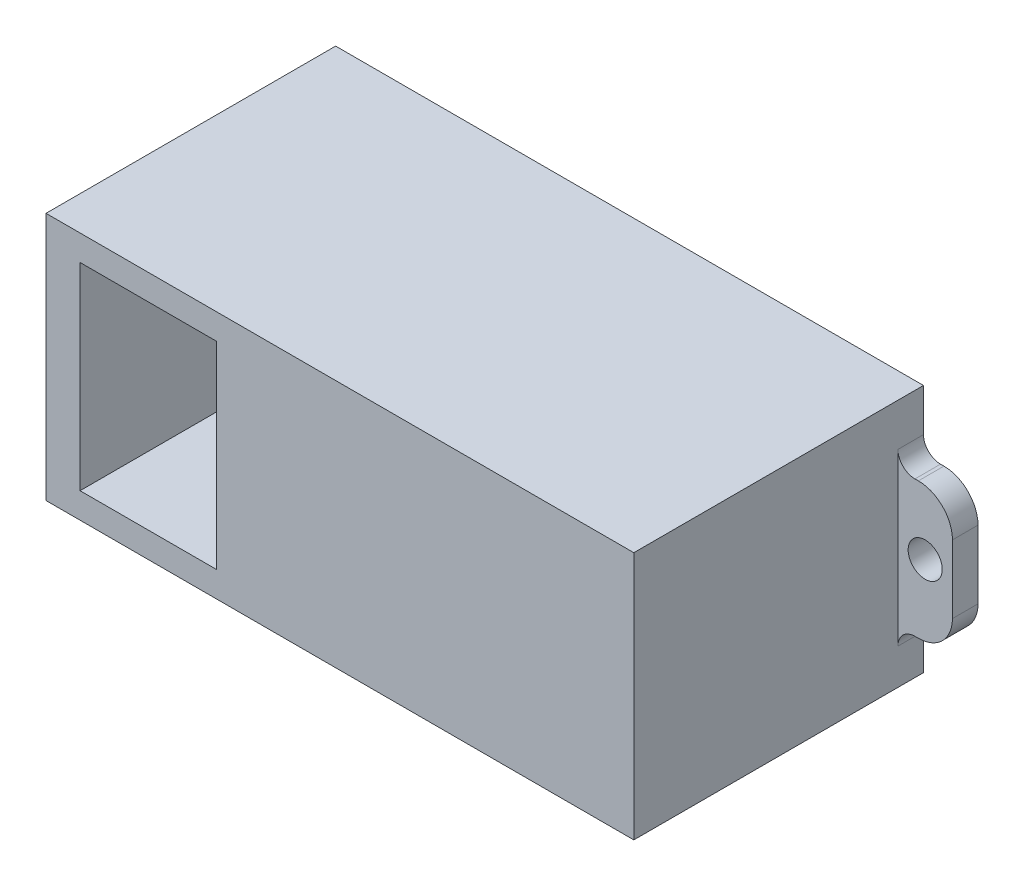
ISO-10303-21;
HEADER;
FILE_DESCRIPTION(('STEP AP214'),'2;1');
FILE_NAME('part.step','',(''),(''),'','','');
FILE_SCHEMA(('AUTOMOTIVE_DESIGN { 1 0 10303 214 1 1 1 1 }'));
ENDSEC;
DATA;
#1=APPLICATION_CONTEXT('core data for automotive mechanical design processes');
#2=APPLICATION_PROTOCOL_DEFINITION('international standard','automotive_design',2000,#1);
#3=PRODUCT_CONTEXT('',#1,'mechanical');
#4=PRODUCT('Part','Part','',(#3));
#5=PRODUCT_RELATED_PRODUCT_CATEGORY('part','',(#4));
#6=PRODUCT_DEFINITION_FORMATION('','',#4);
#7=PRODUCT_DEFINITION_CONTEXT('part definition',#1,'design');
#8=PRODUCT_DEFINITION('design','',#6,#7);
#9=PRODUCT_DEFINITION_SHAPE('','',#8);
#10=(LENGTH_UNIT() NAMED_UNIT(*) SI_UNIT(.MILLI.,.METRE.));
#11=(NAMED_UNIT(*) PLANE_ANGLE_UNIT() SI_UNIT($,.RADIAN.));
#12=(NAMED_UNIT(*) SI_UNIT($,.STERADIAN.) SOLID_ANGLE_UNIT());
#13=UNCERTAINTY_MEASURE_WITH_UNIT(LENGTH_MEASURE(1.E-05),#10,'distance_accuracy_value','');
#14=(GEOMETRIC_REPRESENTATION_CONTEXT(3) GLOBAL_UNCERTAINTY_ASSIGNED_CONTEXT((#13)) GLOBAL_UNIT_ASSIGNED_CONTEXT((#10,
#11,#12)) REPRESENTATION_CONTEXT('',''));
#15=CARTESIAN_POINT('',(0.,0.,0.));
#16=DIRECTION('',(0.,0.,1.));
#17=DIRECTION('',(1.,0.,0.));
#18=AXIS2_PLACEMENT_3D('',#15,#16,#17);
#19=CARTESIAN_POINT('',(-22.25,5.8,0.));
#20=DIRECTION('',(0.,1.,0.));
#21=DIRECTION('',(0.,0.,1.));
#22=AXIS2_PLACEMENT_3D('',#19,#20,#21);
#23=PLANE('',#22);
#24=DIRECTION('',(0.,0.,-1.));
#25=VECTOR('',#24,1.);
#26=CARTESIAN_POINT('',(-20.25,5.8,0.));
#27=LINE('',#26,#25);
#28=CARTESIAN_POINT('',(-20.25,5.8,17.));
#29=VERTEX_POINT('',#28);
#30=CARTESIAN_POINT('',(-20.25,5.8,0.));
#31=VERTEX_POINT('',#30);
#32=EDGE_CURVE('E831',#29,#31,#27,.T.);
#33=ORIENTED_EDGE('',*,*,#32,.T.);
#34=DIRECTION('',(1.,0.,0.));
#35=VECTOR('',#34,1.);
#36=CARTESIAN_POINT('',(-22.25,5.8,0.));
#37=LINE('',#36,#35);
#38=CARTESIAN_POINT('',(-12.25,5.8,0.));
#39=VERTEX_POINT('',#38);
#40=EDGE_CURVE('E234',#31,#39,#37,.T.);
#41=ORIENTED_EDGE('',*,*,#40,.T.);
#42=DIRECTION('',(0.,0.,1.));
#43=VECTOR('',#42,1.);
#44=CARTESIAN_POINT('',(-12.25,5.8,0.));
#45=LINE('',#44,#43);
#46=CARTESIAN_POINT('',(-12.25,5.8,17.));
#47=VERTEX_POINT('',#46);
#48=EDGE_CURVE('E240',#39,#47,#45,.T.);
#49=ORIENTED_EDGE('',*,*,#48,.T.);
#50=DIRECTION('',(1.,0.,0.));
#51=VECTOR('',#50,1.);
#52=CARTESIAN_POINT('',(-22.25,5.8,17.));
#53=LINE('',#52,#51);
#54=EDGE_CURVE('E254',#29,#47,#53,.T.);
#55=ORIENTED_EDGE('',*,*,#54,.F.);
#56=EDGE_LOOP('',(#33,#41,#49,#55));
#57=FACE_BOUND('',#56,.T.);
#58=ADVANCED_FACE('F35',(#57),#23,.F.);
#59=CARTESIAN_POINT('',(-22.25,-5.8,0.));
#60=DIRECTION('',(0.,-1.,0.));
#61=DIRECTION('',(0.,0.,-1.));
#62=AXIS2_PLACEMENT_3D('',#59,#60,#61);
#63=PLANE('',#62);
#64=DIRECTION('',(0.,0.,1.));
#65=VECTOR('',#64,1.);
#66=CARTESIAN_POINT('',(-20.25,-5.8,0.));
#67=LINE('',#66,#65);
#68=CARTESIAN_POINT('',(-20.25,-5.8,0.));
#69=VERTEX_POINT('',#68);
#70=CARTESIAN_POINT('',(-20.25,-5.8,17.));
#71=VERTEX_POINT('',#70);
#72=EDGE_CURVE('E223',#69,#71,#67,.T.);
#73=ORIENTED_EDGE('',*,*,#72,.T.);
#74=DIRECTION('',(1.,0.,0.));
#75=VECTOR('',#74,1.);
#76=CARTESIAN_POINT('',(-22.25,-5.8,17.));
#77=LINE('',#76,#75);
#78=CARTESIAN_POINT('',(-12.25,-5.8,17.));
#79=VERTEX_POINT('',#78);
#80=EDGE_CURVE('E52',#71,#79,#77,.T.);
#81=ORIENTED_EDGE('',*,*,#80,.T.);
#82=DIRECTION('',(0.,0.,-1.));
#83=VECTOR('',#82,1.);
#84=CARTESIAN_POINT('',(-12.25,-5.8,0.));
#85=LINE('',#84,#83);
#86=CARTESIAN_POINT('',(-12.25,-5.8,0.));
#87=VERTEX_POINT('',#86);
#88=EDGE_CURVE('E237',#79,#87,#85,.T.);
#89=ORIENTED_EDGE('',*,*,#88,.T.);
#90=DIRECTION('',(1.,0.,0.));
#91=VECTOR('',#90,1.);
#92=CARTESIAN_POINT('',(-22.25,-5.8,0.));
#93=LINE('',#92,#91);
#94=EDGE_CURVE('E60',#69,#87,#93,.T.);
#95=ORIENTED_EDGE('',*,*,#94,.F.);
#96=EDGE_LOOP('',(#73,#81,#89,#95));
#97=FACE_BOUND('',#96,.T.);
#98=ADVANCED_FACE('F236',(#97),#63,.F.);
#99=CARTESIAN_POINT('',(-12.25,-6.3,16.));
#100=DIRECTION('',(1.,0.,0.));
#101=DIRECTION('',(0.,0.,-1.));
#102=AXIS2_PLACEMENT_3D('',#99,#100,#101);
#103=PLANE('',#102);
#104=ORIENTED_EDGE('',*,*,#88,.F.);
#105=DIRECTION('',(0.,-1.,0.));
#106=VECTOR('',#105,1.);
#107=CARTESIAN_POINT('',(-12.25,-6.3,17.));
#108=LINE('',#107,#106);
#109=EDGE_CURVE('E426',#47,#79,#108,.T.);
#110=ORIENTED_EDGE('',*,*,#109,.F.);
#111=ORIENTED_EDGE('',*,*,#48,.F.);
#112=DIRECTION('',(0.,-1.,0.));
#113=VECTOR('',#112,1.);
#114=CARTESIAN_POINT('',(-12.25,-6.3,0.));
#115=LINE('',#114,#113);
#116=CARTESIAN_POINT('',(-12.25,4.8,0.));
#117=VERTEX_POINT('',#116);
#118=EDGE_CURVE('E438',#39,#117,#115,.T.);
#119=ORIENTED_EDGE('',*,*,#118,.T.);
#120=DIRECTION('',(0.,0.,-1.));
#121=VECTOR('',#120,1.);
#122=CARTESIAN_POINT('',(-12.25,4.80000000000001,1.5));
#123=LINE('',#122,#121);
#124=CARTESIAN_POINT('',(-12.25,4.80000000000001,1.5));
#125=VERTEX_POINT('',#124);
#126=EDGE_CURVE('E312',#125,#117,#123,.T.);
#127=ORIENTED_EDGE('',*,*,#126,.F.);
#128=DIRECTION('',(0.,-1.,0.));
#129=VECTOR('',#128,1.);
#130=CARTESIAN_POINT('',(-12.25,0.,1.5));
#131=LINE('',#130,#129);
#132=CARTESIAN_POINT('',(-12.25,-5.20000000000001,1.5));
#133=VERTEX_POINT('',#132);
#134=EDGE_CURVE('E283',#125,#133,#131,.T.);
#135=ORIENTED_EDGE('',*,*,#134,.T.);
#136=DIRECTION('',(0.,0.,-1.));
#137=VECTOR('',#136,1.);
#138=CARTESIAN_POINT('',(-12.25,-5.20000000000001,1.5));
#139=LINE('',#138,#137);
#140=CARTESIAN_POINT('',(-12.25,-5.20000000000001,0.));
#141=VERTEX_POINT('',#140);
#142=EDGE_CURVE('E308',#133,#141,#139,.T.);
#143=ORIENTED_EDGE('',*,*,#142,.T.);
#144=EDGE_CURVE('E425',#141,#87,#115,.T.);
#145=ORIENTED_EDGE('',*,*,#144,.T.);
#146=EDGE_LOOP('',(#104,#110,#111,#119,#127,#135,#143,#145));
#147=FACE_BOUND('',#146,.T.);
#148=ADVANCED_FACE('F503',(#147),#103,.F.);
#149=CARTESIAN_POINT('',(12.25,-6.3,16.));
#150=DIRECTION('',(-1.,0.,0.));
#151=DIRECTION('',(0.,0.,1.));
#152=AXIS2_PLACEMENT_3D('',#149,#150,#151);
#153=PLANE('',#152);
#154=DIRECTION('',(0.,0.,-1.));
#155=VECTOR('',#154,1.);
#156=CARTESIAN_POINT('',(12.25,-5.20000000000001,1.5));
#157=LINE('',#156,#155);
#158=CARTESIAN_POINT('',(12.25,-5.20000000000001,1.5));
#159=VERTEX_POINT('',#158);
#160=CARTESIAN_POINT('',(12.25,-5.20000000000001,0.));
#161=VERTEX_POINT('',#160);
#162=EDGE_CURVE('E353',#159,#161,#157,.T.);
#163=ORIENTED_EDGE('',*,*,#162,.F.);
#164=DIRECTION('',(0.,-1.,0.));
#165=VECTOR('',#164,1.);
#166=CARTESIAN_POINT('',(12.25,0.,1.5));
#167=LINE('',#166,#165);
#168=CARTESIAN_POINT('',(12.25,4.80000000000001,1.5));
#169=VERTEX_POINT('',#168);
#170=EDGE_CURVE('E334',#169,#159,#167,.T.);
#171=ORIENTED_EDGE('',*,*,#170,.F.);
#172=DIRECTION('',(0.,0.,-1.));
#173=VECTOR('',#172,1.);
#174=CARTESIAN_POINT('',(12.25,4.80000000000001,1.5));
#175=LINE('',#174,#173);
#176=CARTESIAN_POINT('',(12.25,4.80000000000001,0.));
#177=VERTEX_POINT('',#176);
#178=EDGE_CURVE('E390',#169,#177,#175,.T.);
#179=ORIENTED_EDGE('',*,*,#178,.T.);
#180=DIRECTION('',(0.,1.,0.));
#181=VECTOR('',#180,1.);
#182=CARTESIAN_POINT('',(12.25,-6.3,0.));
#183=LINE('',#182,#181);
#184=CARTESIAN_POINT('',(12.25,7.3,0.));
#185=VERTEX_POINT('',#184);
#186=EDGE_CURVE('E441',#177,#185,#183,.T.);
#187=ORIENTED_EDGE('',*,*,#186,.T.);
#188=DIRECTION('',(0.,0.,-1.));
#189=VECTOR('',#188,1.);
#190=CARTESIAN_POINT('',(12.25,7.3,16.));
#191=LINE('',#190,#189);
#192=CARTESIAN_POINT('',(12.25,7.3,17.));
#193=VERTEX_POINT('',#192);
#194=EDGE_CURVE('E44',#193,#185,#191,.T.);
#195=ORIENTED_EDGE('',*,*,#194,.F.);
#196=DIRECTION('',(0.,1.,0.));
#197=VECTOR('',#196,1.);
#198=CARTESIAN_POINT('',(12.25,-6.3,17.));
#199=LINE('',#198,#197);
#200=CARTESIAN_POINT('',(12.25,-7.3,17.));
#201=VERTEX_POINT('',#200);
#202=EDGE_CURVE('E432',#201,#193,#199,.T.);
#203=ORIENTED_EDGE('',*,*,#202,.F.);
#204=DIRECTION('',(0.,0.,-1.));
#205=VECTOR('',#204,1.);
#206=CARTESIAN_POINT('',(12.25,-7.3,16.));
#207=LINE('',#206,#205);
#208=CARTESIAN_POINT('',(12.25,-7.3,0.));
#209=VERTEX_POINT('',#208);
#210=EDGE_CURVE('E11',#201,#209,#207,.T.);
#211=ORIENTED_EDGE('',*,*,#210,.T.);
#212=EDGE_CURVE('E440',#209,#161,#183,.T.);
#213=ORIENTED_EDGE('',*,*,#212,.T.);
#214=EDGE_LOOP('',(#163,#171,#179,#187,#195,#203,#211,#213));
#215=FACE_BOUND('',#214,.T.);
#216=ADVANCED_FACE('F454',(#215),#153,.F.);
#217=CARTESIAN_POINT('',(11.25,-7.3,16.));
#218=DIRECTION('',(0.,1.,0.));
#219=DIRECTION('',(-1.,0.,0.));
#220=AXIS2_PLACEMENT_3D('',#217,#218,#219);
#221=PLANE('',#220);
#222=DIRECTION('',(1.,0.,0.));
#223=VECTOR('',#222,1.);
#224=CARTESIAN_POINT('',(11.25,-7.3,0.));
#225=LINE('',#224,#223);
#226=CARTESIAN_POINT('',(-22.25,-7.3,0.));
#227=VERTEX_POINT('',#226);
#228=EDGE_CURVE('E39',#227,#209,#225,.T.);
#229=ORIENTED_EDGE('',*,*,#228,.T.);
#230=ORIENTED_EDGE('',*,*,#210,.F.);
#231=DIRECTION('',(1.,0.,0.));
#232=VECTOR('',#231,1.);
#233=CARTESIAN_POINT('',(11.25,-7.3,17.));
#234=LINE('',#233,#232);
#235=CARTESIAN_POINT('',(-22.25,-7.3,17.));
#236=VERTEX_POINT('',#235);
#237=EDGE_CURVE('E428',#236,#201,#234,.T.);
#238=ORIENTED_EDGE('',*,*,#237,.F.);
#239=DIRECTION('',(0.,0.,1.));
#240=VECTOR('',#239,1.);
#241=CARTESIAN_POINT('',(-22.25,-7.3,0.));
#242=LINE('',#241,#240);
#243=EDGE_CURVE('E238',#227,#236,#242,.T.);
#244=ORIENTED_EDGE('',*,*,#243,.F.);
#245=EDGE_LOOP('',(#229,#230,#238,#244));
#246=FACE_BOUND('',#245,.T.);
#247=ADVANCED_FACE('F449',(#246),#221,.F.);
#248=CARTESIAN_POINT('',(11.25,7.3,16.));
#249=DIRECTION('',(0.,-1.,0.));
#250=DIRECTION('',(1.,0.,0.));
#251=AXIS2_PLACEMENT_3D('',#248,#249,#250);
#252=PLANE('',#251);
#253=DIRECTION('',(-1.,0.,0.));
#254=VECTOR('',#253,1.);
#255=CARTESIAN_POINT('',(11.25,7.3,0.));
#256=LINE('',#255,#254);
#257=CARTESIAN_POINT('',(-22.25,7.3,0.));
#258=VERTEX_POINT('',#257);
#259=EDGE_CURVE('E429',#185,#258,#256,.T.);
#260=ORIENTED_EDGE('',*,*,#259,.T.);
#261=DIRECTION('',(0.,0.,-1.));
#262=VECTOR('',#261,1.);
#263=CARTESIAN_POINT('',(-22.25,7.3,0.));
#264=LINE('',#263,#262);
#265=CARTESIAN_POINT('',(-22.25,7.3,17.));
#266=VERTEX_POINT('',#265);
#267=EDGE_CURVE('E251',#266,#258,#264,.T.);
#268=ORIENTED_EDGE('',*,*,#267,.F.);
#269=DIRECTION('',(-1.,0.,0.));
#270=VECTOR('',#269,1.);
#271=CARTESIAN_POINT('',(11.25,7.3,17.));
#272=LINE('',#271,#270);
#273=EDGE_CURVE('E435',#193,#266,#272,.T.);
#274=ORIENTED_EDGE('',*,*,#273,.F.);
#275=ORIENTED_EDGE('',*,*,#194,.T.);
#276=EDGE_LOOP('',(#260,#268,#274,#275));
#277=FACE_BOUND('',#276,.T.);
#278=ADVANCED_FACE('F588',(#277),#252,.F.);
#279=CARTESIAN_POINT('',(0.,0.,17.));
#280=DIRECTION('',(0.,0.,1.));
#281=DIRECTION('',(1.,0.,0.));
#282=AXIS2_PLACEMENT_3D('',#279,#280,#281);
#283=PLANE('',#282);
#284=DIRECTION('',(0.,1.,0.));
#285=VECTOR('',#284,1.);
#286=CARTESIAN_POINT('',(-20.25,5.8,17.));
#287=LINE('',#286,#285);
#288=EDGE_CURVE('E228',#71,#29,#287,.T.);
#289=ORIENTED_EDGE('',*,*,#288,.T.);
#290=ORIENTED_EDGE('',*,*,#54,.T.);
#291=ORIENTED_EDGE('',*,*,#109,.T.);
#292=ORIENTED_EDGE('',*,*,#80,.F.);
#293=EDGE_LOOP('',(#289,#290,#291,#292));
#294=FACE_BOUND('',#293,.T.);
#295=ORIENTED_EDGE('',*,*,#273,.T.);
#296=DIRECTION('',(0.,1.,0.));
#297=VECTOR('',#296,1.);
#298=CARTESIAN_POINT('',(-22.25,5.8,17.));
#299=LINE('',#298,#297);
#300=EDGE_CURVE('E248',#236,#266,#299,.T.);
#301=ORIENTED_EDGE('',*,*,#300,.F.);
#302=ORIENTED_EDGE('',*,*,#237,.T.);
#303=ORIENTED_EDGE('',*,*,#202,.T.);
#304=EDGE_LOOP('',(#295,#301,#302,#303));
#305=FACE_BOUND('',#304,.T.);
#306=ADVANCED_FACE('F37',(#294,#305),#283,.T.);
#307=CARTESIAN_POINT('',(0.,0.,0.));
#308=DIRECTION('',(0.,0.,1.));
#309=DIRECTION('',(1.,0.,0.));
#310=AXIS2_PLACEMENT_3D('',#307,#308,#309);
#311=PLANE('',#310);
#312=ORIENTED_EDGE('',*,*,#40,.F.);
#313=DIRECTION('',(0.,-1.,0.));
#314=VECTOR('',#313,1.);
#315=CARTESIAN_POINT('',(-20.25,5.8,0.));
#316=LINE('',#315,#314);
#317=EDGE_CURVE('E226',#31,#69,#316,.T.);
#318=ORIENTED_EDGE('',*,*,#317,.T.);
#319=ORIENTED_EDGE('',*,*,#94,.T.);
#320=ORIENTED_EDGE('',*,*,#144,.F.);
#321=CARTESIAN_POINT('',(-13.25,-5.2,0.));
#322=DIRECTION('',(0.,0.,1.));
#323=DIRECTION('',(1.,0.,0.));
#324=AXIS2_PLACEMENT_3D('',#321,#322,#323);
#325=CIRCLE('',#324,1.);
#326=CARTESIAN_POINT('',(-13.25,-4.2,0.));
#327=VERTEX_POINT('',#326);
#328=EDGE_CURVE('E288',#141,#327,#325,.T.);
#329=ORIENTED_EDGE('',*,*,#328,.T.);
#330=DIRECTION('',(-1.,0.,0.));
#331=VECTOR('',#330,1.);
#332=CARTESIAN_POINT('',(0.,-4.20000000000006,0.));
#333=LINE('',#332,#331);
#334=CARTESIAN_POINT('',(-13.45,-4.2,0.));
#335=VERTEX_POINT('',#334);
#336=EDGE_CURVE('E291',#327,#335,#333,.T.);
#337=ORIENTED_EDGE('',*,*,#336,.T.);
#338=CARTESIAN_POINT('',(-13.45,-2.2,0.));
#339=DIRECTION('',(0.,0.,1.));
#340=DIRECTION('',(1.,0.,0.));
#341=AXIS2_PLACEMENT_3D('',#338,#339,#340);
#342=CIRCLE('',#341,2.);
#343=CARTESIAN_POINT('',(-15.45,-2.2,0.));
#344=VERTEX_POINT('',#343);
#345=EDGE_CURVE('E294',#344,#335,#342,.T.);
#346=ORIENTED_EDGE('',*,*,#345,.F.);
#347=DIRECTION('',(0.,1.,0.));
#348=VECTOR('',#347,1.);
#349=CARTESIAN_POINT('',(-15.45,0.,0.));
#350=LINE('',#349,#348);
#351=CARTESIAN_POINT('',(-15.45,1.8,0.));
#352=VERTEX_POINT('',#351);
#353=EDGE_CURVE('E297',#344,#352,#350,.T.);
#354=ORIENTED_EDGE('',*,*,#353,.T.);
#355=CARTESIAN_POINT('',(-13.45,1.8,0.));
#356=DIRECTION('',(0.,0.,1.));
#357=DIRECTION('',(1.,0.,0.));
#358=AXIS2_PLACEMENT_3D('',#355,#356,#357);
#359=CIRCLE('',#358,2.);
#360=CARTESIAN_POINT('',(-13.45,3.8,0.));
#361=VERTEX_POINT('',#360);
#362=EDGE_CURVE('E300',#361,#352,#359,.T.);
#363=ORIENTED_EDGE('',*,*,#362,.F.);
#364=DIRECTION('',(-1.,0.,0.));
#365=VECTOR('',#364,1.);
#366=CARTESIAN_POINT('',(0.,3.79999999999991,0.));
#367=LINE('',#366,#365);
#368=CARTESIAN_POINT('',(-13.25,3.8,0.));
#369=VERTEX_POINT('',#368);
#370=EDGE_CURVE('E303',#369,#361,#367,.T.);
#371=ORIENTED_EDGE('',*,*,#370,.F.);
#372=CARTESIAN_POINT('',(-13.25,4.8,0.));
#373=DIRECTION('',(0.,0.,1.));
#374=DIRECTION('',(1.,0.,0.));
#375=AXIS2_PLACEMENT_3D('',#372,#373,#374);
#376=CIRCLE('',#375,1.);
#377=EDGE_CURVE('E264',#369,#117,#376,.T.);
#378=ORIENTED_EDGE('',*,*,#377,.T.);
#379=ORIENTED_EDGE('',*,*,#118,.F.);
#380=EDGE_LOOP('',(#312,#318,#319,#320,#329,#337,#346,#354,#363,#371,#378,#379));
#381=FACE_BOUND('',#380,.T.);
#382=DIRECTION('',(-1.,0.,0.));
#383=VECTOR('',#382,1.);
#384=CARTESIAN_POINT('',(11.25,6.3,0.));
#385=LINE('',#384,#383);
#386=CARTESIAN_POINT('',(11.25,6.3,0.));
#387=VERTEX_POINT('',#386);
#388=CARTESIAN_POINT('',(-11.25,6.3,0.));
#389=VERTEX_POINT('',#388);
#390=EDGE_CURVE('E399',#387,#389,#385,.T.);
#391=ORIENTED_EDGE('',*,*,#390,.T.);
#392=DIRECTION('',(0.,-1.,0.));
#393=VECTOR('',#392,1.);
#394=CARTESIAN_POINT('',(-11.25,-6.3,0.));
#395=LINE('',#394,#393);
#396=CARTESIAN_POINT('',(-11.25,-6.3,0.));
#397=VERTEX_POINT('',#396);
#398=EDGE_CURVE('E379',#389,#397,#395,.T.);
#399=ORIENTED_EDGE('',*,*,#398,.T.);
#400=DIRECTION('',(1.,0.,0.));
#401=VECTOR('',#400,1.);
#402=CARTESIAN_POINT('',(11.25,-6.3,0.));
#403=LINE('',#402,#401);
#404=CARTESIAN_POINT('',(11.25,-6.3,0.));
#405=VERTEX_POINT('',#404);
#406=EDGE_CURVE('E408',#397,#405,#403,.T.);
#407=ORIENTED_EDGE('',*,*,#406,.T.);
#408=DIRECTION('',(0.,1.,0.));
#409=VECTOR('',#408,1.);
#410=CARTESIAN_POINT('',(11.25,-6.3,0.));
#411=LINE('',#410,#409);
#412=EDGE_CURVE('E411',#405,#387,#411,.T.);
#413=ORIENTED_EDGE('',*,*,#412,.T.);
#414=EDGE_LOOP('',(#391,#399,#407,#413));
#415=FACE_BOUND('',#414,.T.);
#416=ORIENTED_EDGE('',*,*,#228,.F.);
#417=DIRECTION('',(0.,-1.,0.));
#418=VECTOR('',#417,1.);
#419=CARTESIAN_POINT('',(-22.25,5.8,0.));
#420=LINE('',#419,#418);
#421=EDGE_CURVE('E246',#258,#227,#420,.T.);
#422=ORIENTED_EDGE('',*,*,#421,.F.);
#423=ORIENTED_EDGE('',*,*,#259,.F.);
#424=ORIENTED_EDGE('',*,*,#186,.F.);
#425=CARTESIAN_POINT('',(13.25,4.8,0.));
#426=DIRECTION('',(0.,0.,-1.));
#427=DIRECTION('',(-1.,0.,0.));
#428=AXIS2_PLACEMENT_3D('',#425,#426,#427);
#429=CIRCLE('',#428,1.);
#430=CARTESIAN_POINT('',(13.25,3.8,0.));
#431=VERTEX_POINT('',#430);
#432=EDGE_CURVE('E359',#431,#177,#429,.T.);
#433=ORIENTED_EDGE('',*,*,#432,.F.);
#434=DIRECTION('',(1.,0.,0.));
#435=VECTOR('',#434,1.);
#436=CARTESIAN_POINT('',(0.,3.79999999999991,0.));
#437=LINE('',#436,#435);
#438=CARTESIAN_POINT('',(13.45,3.8,0.));
#439=VERTEX_POINT('',#438);
#440=EDGE_CURVE('E362',#431,#439,#437,.T.);
#441=ORIENTED_EDGE('',*,*,#440,.T.);
#442=CARTESIAN_POINT('',(13.45,1.8,0.));
#443=DIRECTION('',(0.,0.,-1.));
#444=DIRECTION('',(-1.,0.,0.));
#445=AXIS2_PLACEMENT_3D('',#442,#443,#444);
#446=CIRCLE('',#445,2.);
#447=CARTESIAN_POINT('',(15.45,1.8,0.));
#448=VERTEX_POINT('',#447);
#449=EDGE_CURVE('E365',#439,#448,#446,.T.);
#450=ORIENTED_EDGE('',*,*,#449,.T.);
#451=DIRECTION('',(0.,1.,0.));
#452=VECTOR('',#451,1.);
#453=CARTESIAN_POINT('',(15.45,0.,0.));
#454=LINE('',#453,#452);
#455=CARTESIAN_POINT('',(15.45,-2.2,0.));
#456=VERTEX_POINT('',#455);
#457=EDGE_CURVE('E368',#456,#448,#454,.T.);
#458=ORIENTED_EDGE('',*,*,#457,.F.);
#459=CARTESIAN_POINT('',(13.45,-2.2,0.));
#460=DIRECTION('',(0.,0.,-1.));
#461=DIRECTION('',(-1.,0.,0.));
#462=AXIS2_PLACEMENT_3D('',#459,#460,#461);
#463=CIRCLE('',#462,2.);
#464=CARTESIAN_POINT('',(13.45,-4.2,0.));
#465=VERTEX_POINT('',#464);
#466=EDGE_CURVE('E371',#456,#465,#463,.T.);
#467=ORIENTED_EDGE('',*,*,#466,.T.);
#468=DIRECTION('',(1.,0.,0.));
#469=VECTOR('',#468,1.);
#470=CARTESIAN_POINT('',(0.,-4.20000000000006,0.));
#471=LINE('',#470,#469);
#472=CARTESIAN_POINT('',(13.25,-4.2,0.));
#473=VERTEX_POINT('',#472);
#474=EDGE_CURVE('E331',#473,#465,#471,.T.);
#475=ORIENTED_EDGE('',*,*,#474,.F.);
#476=CARTESIAN_POINT('',(13.25,-5.2,0.));
#477=DIRECTION('',(0.,0.,-1.));
#478=DIRECTION('',(-1.,0.,0.));
#479=AXIS2_PLACEMENT_3D('',#476,#477,#478);
#480=CIRCLE('',#479,1.);
#481=EDGE_CURVE('E356',#161,#473,#480,.T.);
#482=ORIENTED_EDGE('',*,*,#481,.F.);
#483=ORIENTED_EDGE('',*,*,#212,.F.);
#484=EDGE_LOOP('',(#416,#422,#423,#424,#433,#441,#450,#458,#467,#475,#482,#483));
#485=FACE_BOUND('',#484,.T.);
#486=CARTESIAN_POINT('',(13.85,0.,0.));
#487=DIRECTION('',(0.,0.,-1.));
#488=DIRECTION('',(-1.,0.,0.));
#489=AXIS2_PLACEMENT_3D('',#486,#487,#488);
#490=CIRCLE('',#489,1.);
#491=CARTESIAN_POINT('',(12.85,0.,0.));
#492=VERTEX_POINT('',#491);
#493=EDGE_CURVE('E311',#492,#492,#490,.T.);
#494=ORIENTED_EDGE('',*,*,#493,.F.);
#495=EDGE_LOOP('',(#494));
#496=FACE_BOUND('',#495,.T.);
#497=CARTESIAN_POINT('',(-13.85,0.,0.));
#498=DIRECTION('',(0.,0.,1.));
#499=DIRECTION('',(1.,0.,0.));
#500=AXIS2_PLACEMENT_3D('',#497,#498,#499);
#501=CIRCLE('',#500,1.);
#502=CARTESIAN_POINT('',(-12.85,0.,0.));
#503=VERTEX_POINT('',#502);
#504=EDGE_CURVE('E259',#503,#503,#501,.T.);
#505=ORIENTED_EDGE('',*,*,#504,.T.);
#506=EDGE_LOOP('',(#505));
#507=FACE_BOUND('',#506,.T.);
#508=ADVANCED_FACE('F231',(#381,#415,#485,#496,#507),#311,.F.);
#509=CARTESIAN_POINT('',(-11.25,-6.3,16.));
#510=DIRECTION('',(1.,0.,0.));
#511=DIRECTION('',(0.,0.,-1.));
#512=AXIS2_PLACEMENT_3D('',#509,#510,#511);
#513=PLANE('',#512);
#514=ORIENTED_EDGE('',*,*,#398,.F.);
#515=DIRECTION('',(0.,0.,-1.));
#516=VECTOR('',#515,1.);
#517=CARTESIAN_POINT('',(-11.25,6.3,16.));
#518=LINE('',#517,#516);
#519=CARTESIAN_POINT('',(-11.25,6.3,16.));
#520=VERTEX_POINT('',#519);
#521=EDGE_CURVE('E405',#520,#389,#518,.T.);
#522=ORIENTED_EDGE('',*,*,#521,.F.);
#523=DIRECTION('',(0.,-1.,0.));
#524=VECTOR('',#523,1.);
#525=CARTESIAN_POINT('',(-11.25,-6.3,16.));
#526=LINE('',#525,#524);
#527=CARTESIAN_POINT('',(-11.25,-6.3,16.));
#528=VERTEX_POINT('',#527);
#529=EDGE_CURVE('E395',#520,#528,#526,.T.);
#530=ORIENTED_EDGE('',*,*,#529,.T.);
#531=DIRECTION('',(0.,0.,-1.));
#532=VECTOR('',#531,1.);
#533=CARTESIAN_POINT('',(-11.25,-6.3,16.));
#534=LINE('',#533,#532);
#535=EDGE_CURVE('E422',#528,#397,#534,.T.);
#536=ORIENTED_EDGE('',*,*,#535,.T.);
#537=EDGE_LOOP('',(#514,#522,#530,#536));
#538=FACE_BOUND('',#537,.T.);
#539=ADVANCED_FACE('F576',(#538),#513,.T.);
#540=CARTESIAN_POINT('',(11.25,-6.3,16.));
#541=DIRECTION('',(0.,1.,0.));
#542=DIRECTION('',(-1.,0.,0.));
#543=AXIS2_PLACEMENT_3D('',#540,#541,#542);
#544=PLANE('',#543);
#545=ORIENTED_EDGE('',*,*,#406,.F.);
#546=ORIENTED_EDGE('',*,*,#535,.F.);
#547=DIRECTION('',(1.,0.,0.));
#548=VECTOR('',#547,1.);
#549=CARTESIAN_POINT('',(11.25,-6.3,16.));
#550=LINE('',#549,#548);
#551=CARTESIAN_POINT('',(11.25,-6.3,16.));
#552=VERTEX_POINT('',#551);
#553=EDGE_CURVE('E398',#528,#552,#550,.T.);
#554=ORIENTED_EDGE('',*,*,#553,.T.);
#555=DIRECTION('',(0.,0.,-1.));
#556=VECTOR('',#555,1.);
#557=CARTESIAN_POINT('',(11.25,-6.3,16.));
#558=LINE('',#557,#556);
#559=EDGE_CURVE('E419',#552,#405,#558,.T.);
#560=ORIENTED_EDGE('',*,*,#559,.T.);
#561=EDGE_LOOP('',(#545,#546,#554,#560));
#562=FACE_BOUND('',#561,.T.);
#563=ADVANCED_FACE('F572',(#562),#544,.T.);
#564=CARTESIAN_POINT('',(11.25,-6.3,16.));
#565=DIRECTION('',(-1.,0.,0.));
#566=DIRECTION('',(0.,0.,1.));
#567=AXIS2_PLACEMENT_3D('',#564,#565,#566);
#568=PLANE('',#567);
#569=ORIENTED_EDGE('',*,*,#412,.F.);
#570=ORIENTED_EDGE('',*,*,#559,.F.);
#571=DIRECTION('',(0.,1.,0.));
#572=VECTOR('',#571,1.);
#573=CARTESIAN_POINT('',(11.25,-6.3,16.));
#574=LINE('',#573,#572);
#575=CARTESIAN_POINT('',(11.25,6.3,16.));
#576=VERTEX_POINT('',#575);
#577=EDGE_CURVE('E401',#552,#576,#574,.T.);
#578=ORIENTED_EDGE('',*,*,#577,.T.);
#579=DIRECTION('',(0.,0.,-1.));
#580=VECTOR('',#579,1.);
#581=CARTESIAN_POINT('',(11.25,6.3,16.));
#582=LINE('',#581,#580);
#583=EDGE_CURVE('E417',#576,#387,#582,.T.);
#584=ORIENTED_EDGE('',*,*,#583,.T.);
#585=EDGE_LOOP('',(#569,#570,#578,#584));
#586=FACE_BOUND('',#585,.T.);
#587=ADVANCED_FACE('F568',(#586),#568,.T.);
#588=CARTESIAN_POINT('',(11.25,6.3,16.));
#589=DIRECTION('',(0.,-1.,0.));
#590=DIRECTION('',(1.,0.,0.));
#591=AXIS2_PLACEMENT_3D('',#588,#589,#590);
#592=PLANE('',#591);
#593=ORIENTED_EDGE('',*,*,#390,.F.);
#594=ORIENTED_EDGE('',*,*,#583,.F.);
#595=DIRECTION('',(-1.,0.,0.));
#596=VECTOR('',#595,1.);
#597=CARTESIAN_POINT('',(11.25,6.3,16.));
#598=LINE('',#597,#596);
#599=EDGE_CURVE('E403',#576,#520,#598,.T.);
#600=ORIENTED_EDGE('',*,*,#599,.T.);
#601=ORIENTED_EDGE('',*,*,#521,.T.);
#602=EDGE_LOOP('',(#593,#594,#600,#601));
#603=FACE_BOUND('',#602,.T.);
#604=ADVANCED_FACE('F557',(#603),#592,.T.);
#605=CARTESIAN_POINT('',(0.,0.,16.));
#606=DIRECTION('',(0.,0.,1.));
#607=DIRECTION('',(1.,0.,0.));
#608=AXIS2_PLACEMENT_3D('',#605,#606,#607);
#609=PLANE('',#608);
#610=ORIENTED_EDGE('',*,*,#529,.F.);
#611=ORIENTED_EDGE('',*,*,#599,.F.);
#612=ORIENTED_EDGE('',*,*,#577,.F.);
#613=ORIENTED_EDGE('',*,*,#553,.F.);
#614=EDGE_LOOP('',(#610,#611,#612,#613));
#615=FACE_BOUND('',#614,.T.);
#616=ADVANCED_FACE('F552',(#615),#609,.F.);
#617=CARTESIAN_POINT('',(13.25,-5.2,1.5));
#618=DIRECTION('',(0.,0.,-1.));
#619=DIRECTION('',(-1.,0.,0.));
#620=AXIS2_PLACEMENT_3D('',#617,#618,#619);
#621=CYLINDRICAL_SURFACE('',#620,1.);
#622=ORIENTED_EDGE('',*,*,#481,.T.);
#623=DIRECTION('',(0.,0.,-1.));
#624=VECTOR('',#623,1.);
#625=CARTESIAN_POINT('',(13.25,-4.2,1.5));
#626=LINE('',#625,#624);
#627=CARTESIAN_POINT('',(13.25,-4.2,1.5));
#628=VERTEX_POINT('',#627);
#629=EDGE_CURVE('E376',#628,#473,#626,.T.);
#630=ORIENTED_EDGE('',*,*,#629,.F.);
#631=CARTESIAN_POINT('',(13.25,-5.2,1.5));
#632=DIRECTION('',(0.,0.,-1.));
#633=DIRECTION('',(-1.,0.,0.));
#634=AXIS2_PLACEMENT_3D('',#631,#632,#633);
#635=CIRCLE('',#634,1.);
#636=EDGE_CURVE('E330',#159,#628,#635,.T.);
#637=ORIENTED_EDGE('',*,*,#636,.F.);
#638=ORIENTED_EDGE('',*,*,#162,.T.);
#639=EDGE_LOOP('',(#622,#630,#637,#638));
#640=FACE_BOUND('',#639,.T.);
#641=ADVANCED_FACE('F459',(#640),#621,.F.);
#642=CARTESIAN_POINT('',(0.,-4.20000000000006,1.5));
#643=DIRECTION('',(0.,1.,0.));
#644=DIRECTION('',(-1.,0.,0.));
#645=AXIS2_PLACEMENT_3D('',#642,#643,#644);
#646=PLANE('',#645);
#647=ORIENTED_EDGE('',*,*,#474,.T.);
#648=DIRECTION('',(0.,0.,-1.));
#649=VECTOR('',#648,1.);
#650=CARTESIAN_POINT('',(13.45,-4.2,1.5));
#651=LINE('',#650,#649);
#652=CARTESIAN_POINT('',(13.45,-4.2,1.5));
#653=VERTEX_POINT('',#652);
#654=EDGE_CURVE('E380',#653,#465,#651,.T.);
#655=ORIENTED_EDGE('',*,*,#654,.F.);
#656=DIRECTION('',(1.,0.,0.));
#657=VECTOR('',#656,1.);
#658=CARTESIAN_POINT('',(0.,-4.20000000000006,1.5));
#659=LINE('',#658,#657);
#660=EDGE_CURVE('E351',#628,#653,#659,.T.);
#661=ORIENTED_EDGE('',*,*,#660,.F.);
#662=ORIENTED_EDGE('',*,*,#629,.T.);
#663=EDGE_LOOP('',(#647,#655,#661,#662));
#664=FACE_BOUND('',#663,.T.);
#665=ADVANCED_FACE('F487',(#664),#646,.F.);
#666=CARTESIAN_POINT('',(13.45,-2.2,1.5));
#667=DIRECTION('',(0.,0.,-1.));
#668=DIRECTION('',(-1.,0.,0.));
#669=AXIS2_PLACEMENT_3D('',#666,#667,#668);
#670=CYLINDRICAL_SURFACE('',#669,2.);
#671=ORIENTED_EDGE('',*,*,#466,.F.);
#672=DIRECTION('',(0.,0.,-1.));
#673=VECTOR('',#672,1.);
#674=CARTESIAN_POINT('',(15.45,-2.2,1.5));
#675=LINE('',#674,#673);
#676=CARTESIAN_POINT('',(15.45,-2.2,1.5));
#677=VERTEX_POINT('',#676);
#678=EDGE_CURVE('E382',#677,#456,#675,.T.);
#679=ORIENTED_EDGE('',*,*,#678,.F.);
#680=CARTESIAN_POINT('',(13.45,-2.2,1.5));
#681=DIRECTION('',(0.,0.,-1.));
#682=DIRECTION('',(-1.,0.,0.));
#683=AXIS2_PLACEMENT_3D('',#680,#681,#682);
#684=CIRCLE('',#683,2.);
#685=EDGE_CURVE('E348',#677,#653,#684,.T.);
#686=ORIENTED_EDGE('',*,*,#685,.T.);
#687=ORIENTED_EDGE('',*,*,#654,.T.);
#688=EDGE_LOOP('',(#671,#679,#686,#687));
#689=FACE_BOUND('',#688,.T.);
#690=ADVANCED_FACE('F482',(#689),#670,.T.);
#691=CARTESIAN_POINT('',(15.45,0.,1.5));
#692=DIRECTION('',(-1.,0.,0.));
#693=DIRECTION('',(0.,0.,1.));
#694=AXIS2_PLACEMENT_3D('',#691,#692,#693);
#695=PLANE('',#694);
#696=ORIENTED_EDGE('',*,*,#457,.T.);
#697=DIRECTION('',(0.,0.,-1.));
#698=VECTOR('',#697,1.);
#699=CARTESIAN_POINT('',(15.45,1.8,1.5));
#700=LINE('',#699,#698);
#701=CARTESIAN_POINT('',(15.45,1.8,1.5));
#702=VERTEX_POINT('',#701);
#703=EDGE_CURVE('E384',#702,#448,#700,.T.);
#704=ORIENTED_EDGE('',*,*,#703,.F.);
#705=DIRECTION('',(0.,1.,0.));
#706=VECTOR('',#705,1.);
#707=CARTESIAN_POINT('',(15.45,0.,1.5));
#708=LINE('',#707,#706);
#709=EDGE_CURVE('E346',#677,#702,#708,.T.);
#710=ORIENTED_EDGE('',*,*,#709,.F.);
#711=ORIENTED_EDGE('',*,*,#678,.T.);
#712=EDGE_LOOP('',(#696,#704,#710,#711));
#713=FACE_BOUND('',#712,.T.);
#714=ADVANCED_FACE('F488',(#713),#695,.F.);
#715=CARTESIAN_POINT('',(13.45,1.8,1.5));
#716=DIRECTION('',(0.,0.,-1.));
#717=DIRECTION('',(-1.,0.,0.));
#718=AXIS2_PLACEMENT_3D('',#715,#716,#717);
#719=CYLINDRICAL_SURFACE('',#718,2.);
#720=ORIENTED_EDGE('',*,*,#449,.F.);
#721=DIRECTION('',(0.,0.,-1.));
#722=VECTOR('',#721,1.);
#723=CARTESIAN_POINT('',(13.45,3.8,1.5));
#724=LINE('',#723,#722);
#725=CARTESIAN_POINT('',(13.45,3.8,1.5));
#726=VERTEX_POINT('',#725);
#727=EDGE_CURVE('E386',#726,#439,#724,.T.);
#728=ORIENTED_EDGE('',*,*,#727,.F.);
#729=CARTESIAN_POINT('',(13.45,1.8,1.5));
#730=DIRECTION('',(0.,0.,-1.));
#731=DIRECTION('',(-1.,0.,0.));
#732=AXIS2_PLACEMENT_3D('',#729,#730,#731);
#733=CIRCLE('',#732,2.);
#734=EDGE_CURVE('E343',#726,#702,#733,.T.);
#735=ORIENTED_EDGE('',*,*,#734,.T.);
#736=ORIENTED_EDGE('',*,*,#703,.T.);
#737=EDGE_LOOP('',(#720,#728,#735,#736));
#738=FACE_BOUND('',#737,.T.);
#739=ADVANCED_FACE('F476',(#738),#719,.T.);
#740=CARTESIAN_POINT('',(0.,3.79999999999991,1.5));
#741=DIRECTION('',(0.,1.,0.));
#742=DIRECTION('',(-1.,0.,0.));
#743=AXIS2_PLACEMENT_3D('',#740,#741,#742);
#744=PLANE('',#743);
#745=ORIENTED_EDGE('',*,*,#440,.F.);
#746=DIRECTION('',(0.,0.,-1.));
#747=VECTOR('',#746,1.);
#748=CARTESIAN_POINT('',(13.25,3.8,1.5));
#749=LINE('',#748,#747);
#750=CARTESIAN_POINT('',(13.25,3.8,1.5));
#751=VERTEX_POINT('',#750);
#752=EDGE_CURVE('E388',#751,#431,#749,.T.);
#753=ORIENTED_EDGE('',*,*,#752,.F.);
#754=DIRECTION('',(1.,0.,0.));
#755=VECTOR('',#754,1.);
#756=CARTESIAN_POINT('',(0.,3.79999999999991,1.5));
#757=LINE('',#756,#755);
#758=EDGE_CURVE('E340',#751,#726,#757,.T.);
#759=ORIENTED_EDGE('',*,*,#758,.T.);
#760=ORIENTED_EDGE('',*,*,#727,.T.);
#761=EDGE_LOOP('',(#745,#753,#759,#760));
#762=FACE_BOUND('',#761,.T.);
#763=ADVANCED_FACE('F473',(#762),#744,.T.);
#764=CARTESIAN_POINT('',(13.25,4.8,1.5));
#765=DIRECTION('',(0.,0.,-1.));
#766=DIRECTION('',(-1.,0.,0.));
#767=AXIS2_PLACEMENT_3D('',#764,#765,#766);
#768=CYLINDRICAL_SURFACE('',#767,1.);
#769=ORIENTED_EDGE('',*,*,#432,.T.);
#770=ORIENTED_EDGE('',*,*,#178,.F.);
#771=CARTESIAN_POINT('',(13.25,4.8,1.5));
#772=DIRECTION('',(0.,0.,-1.));
#773=DIRECTION('',(-1.,0.,0.));
#774=AXIS2_PLACEMENT_3D('',#771,#772,#773);
#775=CIRCLE('',#774,1.);
#776=EDGE_CURVE('E337',#751,#169,#775,.T.);
#777=ORIENTED_EDGE('',*,*,#776,.F.);
#778=ORIENTED_EDGE('',*,*,#752,.T.);
#779=EDGE_LOOP('',(#769,#770,#777,#778));
#780=FACE_BOUND('',#779,.T.);
#781=ADVANCED_FACE('F468',(#780),#768,.F.);
#782=CARTESIAN_POINT('',(13.85,0.,1.5));
#783=DIRECTION('',(0.,0.,-1.));
#784=DIRECTION('',(-1.,0.,0.));
#785=AXIS2_PLACEMENT_3D('',#782,#783,#784);
#786=CYLINDRICAL_SURFACE('',#785,1.);
#787=CARTESIAN_POINT('',(13.85,0.,1.5));
#788=DIRECTION('',(0.,0.,-1.));
#789=DIRECTION('',(-1.,0.,0.));
#790=AXIS2_PLACEMENT_3D('',#787,#788,#789);
#791=CIRCLE('',#790,1.);
#792=CARTESIAN_POINT('',(12.85,0.,1.5));
#793=VERTEX_POINT('',#792);
#794=EDGE_CURVE('E327',#793,#793,#791,.T.);
#795=ORIENTED_EDGE('',*,*,#794,.F.);
#796=EDGE_LOOP('',(#795));
#797=FACE_BOUND('',#796,.T.);
#798=ORIENTED_EDGE('',*,*,#493,.T.);
#799=EDGE_LOOP('',(#798));
#800=FACE_BOUND('',#799,.T.);
#801=ADVANCED_FACE('F546',(#797,#800),#786,.F.);
#802=CARTESIAN_POINT('',(0.,0.,1.5));
#803=DIRECTION('',(0.,0.,-1.));
#804=DIRECTION('',(-1.,0.,0.));
#805=AXIS2_PLACEMENT_3D('',#802,#803,#804);
#806=PLANE('',#805);
#807=ORIENTED_EDGE('',*,*,#794,.T.);
#808=EDGE_LOOP('',(#807));
#809=FACE_BOUND('',#808,.T.);
#810=ORIENTED_EDGE('',*,*,#636,.T.);
#811=ORIENTED_EDGE('',*,*,#660,.T.);
#812=ORIENTED_EDGE('',*,*,#685,.F.);
#813=ORIENTED_EDGE('',*,*,#709,.T.);
#814=ORIENTED_EDGE('',*,*,#734,.F.);
#815=ORIENTED_EDGE('',*,*,#758,.F.);
#816=ORIENTED_EDGE('',*,*,#776,.T.);
#817=ORIENTED_EDGE('',*,*,#170,.T.);
#818=EDGE_LOOP('',(#810,#811,#812,#813,#814,#815,#816,#817));
#819=FACE_BOUND('',#818,.T.);
#820=ADVANCED_FACE('F462',(#809,#819),#806,.F.);
#821=CARTESIAN_POINT('',(-13.25,-5.2,1.5));
#822=DIRECTION('',(0.,0.,-1.));
#823=DIRECTION('',(-1.,0.,0.));
#824=AXIS2_PLACEMENT_3D('',#821,#822,#823);
#825=CYLINDRICAL_SURFACE('',#824,1.);
#826=ORIENTED_EDGE('',*,*,#328,.F.);
#827=ORIENTED_EDGE('',*,*,#142,.F.);
#828=CARTESIAN_POINT('',(-13.25,-5.2,1.5));
#829=DIRECTION('',(0.,0.,1.));
#830=DIRECTION('',(1.,0.,0.));
#831=AXIS2_PLACEMENT_3D('',#828,#829,#830);
#832=CIRCLE('',#831,1.);
#833=CARTESIAN_POINT('',(-13.25,-4.2,1.5));
#834=VERTEX_POINT('',#833);
#835=EDGE_CURVE('E263',#133,#834,#832,.T.);
#836=ORIENTED_EDGE('',*,*,#835,.T.);
#837=DIRECTION('',(0.,0.,-1.));
#838=VECTOR('',#837,1.);
#839=CARTESIAN_POINT('',(-13.25,-4.2,1.5));
#840=LINE('',#839,#838);
#841=EDGE_CURVE('E285',#834,#327,#840,.T.);
#842=ORIENTED_EDGE('',*,*,#841,.T.);
#843=EDGE_LOOP('',(#826,#827,#836,#842));
#844=FACE_BOUND('',#843,.T.);
#845=ADVANCED_FACE('F517',(#844),#825,.F.);
#846=CARTESIAN_POINT('',(-13.25,4.8,1.5));
#847=DIRECTION('',(0.,0.,-1.));
#848=DIRECTION('',(-1.,0.,0.));
#849=AXIS2_PLACEMENT_3D('',#846,#847,#848);
#850=CYLINDRICAL_SURFACE('',#849,1.);
#851=ORIENTED_EDGE('',*,*,#377,.F.);
#852=DIRECTION('',(0.,0.,-1.));
#853=VECTOR('',#852,1.);
#854=CARTESIAN_POINT('',(-13.25,3.8,1.5));
#855=LINE('',#854,#853);
#856=CARTESIAN_POINT('',(-13.25,3.8,1.5));
#857=VERTEX_POINT('',#856);
#858=EDGE_CURVE('E315',#857,#369,#855,.T.);
#859=ORIENTED_EDGE('',*,*,#858,.F.);
#860=CARTESIAN_POINT('',(-13.25,4.8,1.5));
#861=DIRECTION('',(0.,0.,1.));
#862=DIRECTION('',(1.,0.,0.));
#863=AXIS2_PLACEMENT_3D('',#860,#861,#862);
#864=CIRCLE('',#863,1.);
#865=EDGE_CURVE('E280',#857,#125,#864,.T.);
#866=ORIENTED_EDGE('',*,*,#865,.T.);
#867=ORIENTED_EDGE('',*,*,#126,.T.);
#868=EDGE_LOOP('',(#851,#859,#866,#867));
#869=FACE_BOUND('',#868,.T.);
#870=ADVANCED_FACE('F513',(#869),#850,.F.);
#871=CARTESIAN_POINT('',(0.,3.79999999999991,1.5));
#872=DIRECTION('',(0.,-1.,0.));
#873=DIRECTION('',(1.,0.,0.));
#874=AXIS2_PLACEMENT_3D('',#871,#872,#873);
#875=PLANE('',#874);
#876=ORIENTED_EDGE('',*,*,#370,.T.);
#877=DIRECTION('',(0.,0.,-1.));
#878=VECTOR('',#877,1.);
#879=CARTESIAN_POINT('',(-13.45,3.8,1.5));
#880=LINE('',#879,#878);
#881=CARTESIAN_POINT('',(-13.45,3.8,1.5));
#882=VERTEX_POINT('',#881);
#883=EDGE_CURVE('E317',#882,#361,#880,.T.);
#884=ORIENTED_EDGE('',*,*,#883,.F.);
#885=DIRECTION('',(-1.,0.,0.));
#886=VECTOR('',#885,1.);
#887=CARTESIAN_POINT('',(0.,3.79999999999991,1.5));
#888=LINE('',#887,#886);
#889=EDGE_CURVE('E277',#857,#882,#888,.T.);
#890=ORIENTED_EDGE('',*,*,#889,.F.);
#891=ORIENTED_EDGE('',*,*,#858,.T.);
#892=EDGE_LOOP('',(#876,#884,#890,#891));
#893=FACE_BOUND('',#892,.T.);
#894=ADVANCED_FACE('F516',(#893),#875,.F.);
#895=CARTESIAN_POINT('',(-13.45,1.8,1.5));
#896=DIRECTION('',(0.,0.,-1.));
#897=DIRECTION('',(-1.,0.,0.));
#898=AXIS2_PLACEMENT_3D('',#895,#896,#897);
#899=CYLINDRICAL_SURFACE('',#898,2.);
#900=ORIENTED_EDGE('',*,*,#362,.T.);
#901=DIRECTION('',(0.,0.,-1.));
#902=VECTOR('',#901,1.);
#903=CARTESIAN_POINT('',(-15.45,1.8,1.5));
#904=LINE('',#903,#902);
#905=CARTESIAN_POINT('',(-15.45,1.8,1.5));
#906=VERTEX_POINT('',#905);
#907=EDGE_CURVE('E320',#906,#352,#904,.T.);
#908=ORIENTED_EDGE('',*,*,#907,.F.);
#909=CARTESIAN_POINT('',(-13.45,1.8,1.5));
#910=DIRECTION('',(0.,0.,1.));
#911=DIRECTION('',(1.,0.,0.));
#912=AXIS2_PLACEMENT_3D('',#909,#910,#911);
#913=CIRCLE('',#912,2.);
#914=EDGE_CURVE('E275',#882,#906,#913,.T.);
#915=ORIENTED_EDGE('',*,*,#914,.F.);
#916=ORIENTED_EDGE('',*,*,#883,.T.);
#917=EDGE_LOOP('',(#900,#908,#915,#916));
#918=FACE_BOUND('',#917,.T.);
#919=ADVANCED_FACE('F521',(#918),#899,.T.);
#920=CARTESIAN_POINT('',(-15.45,0.,1.5));
#921=DIRECTION('',(-1.,0.,0.));
#922=DIRECTION('',(0.,0.,1.));
#923=AXIS2_PLACEMENT_3D('',#920,#921,#922);
#924=PLANE('',#923);
#925=ORIENTED_EDGE('',*,*,#353,.F.);
#926=DIRECTION('',(0.,0.,-1.));
#927=VECTOR('',#926,1.);
#928=CARTESIAN_POINT('',(-15.45,-2.2,1.5));
#929=LINE('',#928,#927);
#930=CARTESIAN_POINT('',(-15.45,-2.2,1.5));
#931=VERTEX_POINT('',#930);
#932=EDGE_CURVE('E322',#931,#344,#929,.T.);
#933=ORIENTED_EDGE('',*,*,#932,.F.);
#934=DIRECTION('',(0.,1.,0.));
#935=VECTOR('',#934,1.);
#936=CARTESIAN_POINT('',(-15.45,0.,1.5));
#937=LINE('',#936,#935);
#938=EDGE_CURVE('E272',#931,#906,#937,.T.);
#939=ORIENTED_EDGE('',*,*,#938,.T.);
#940=ORIENTED_EDGE('',*,*,#907,.T.);
#941=EDGE_LOOP('',(#925,#933,#939,#940));
#942=FACE_BOUND('',#941,.T.);
#943=ADVANCED_FACE('F525',(#942),#924,.T.);
#944=CARTESIAN_POINT('',(-13.45,-2.2,1.5));
#945=DIRECTION('',(0.,0.,-1.));
#946=DIRECTION('',(-1.,0.,0.));
#947=AXIS2_PLACEMENT_3D('',#944,#945,#946);
#948=CYLINDRICAL_SURFACE('',#947,2.);
#949=ORIENTED_EDGE('',*,*,#345,.T.);
#950=DIRECTION('',(0.,0.,-1.));
#951=VECTOR('',#950,1.);
#952=CARTESIAN_POINT('',(-13.45,-4.2,1.5));
#953=LINE('',#952,#951);
#954=CARTESIAN_POINT('',(-13.45,-4.2,1.5));
#955=VERTEX_POINT('',#954);
#956=EDGE_CURVE('E324',#955,#335,#953,.T.);
#957=ORIENTED_EDGE('',*,*,#956,.F.);
#958=CARTESIAN_POINT('',(-13.45,-2.2,1.5));
#959=DIRECTION('',(0.,0.,1.));
#960=DIRECTION('',(1.,0.,0.));
#961=AXIS2_PLACEMENT_3D('',#958,#959,#960);
#962=CIRCLE('',#961,2.);
#963=EDGE_CURVE('E270',#931,#955,#962,.T.);
#964=ORIENTED_EDGE('',*,*,#963,.F.);
#965=ORIENTED_EDGE('',*,*,#932,.T.);
#966=EDGE_LOOP('',(#949,#957,#964,#965));
#967=FACE_BOUND('',#966,.T.);
#968=ADVANCED_FACE('F529',(#967),#948,.T.);
#969=CARTESIAN_POINT('',(-13.85,0.,1.5));
#970=DIRECTION('',(0.,0.,-1.));
#971=DIRECTION('',(-1.,0.,0.));
#972=AXIS2_PLACEMENT_3D('',#969,#970,#971);
#973=CYLINDRICAL_SURFACE('',#972,1.);
#974=CARTESIAN_POINT('',(-13.85,0.,1.5));
#975=DIRECTION('',(0.,0.,1.));
#976=DIRECTION('',(1.,0.,0.));
#977=AXIS2_PLACEMENT_3D('',#974,#975,#976);
#978=CIRCLE('',#977,1.);
#979=CARTESIAN_POINT('',(-12.85,0.,1.5));
#980=VERTEX_POINT('',#979);
#981=EDGE_CURVE('E260',#980,#980,#978,.T.);
#982=ORIENTED_EDGE('',*,*,#981,.T.);
#983=EDGE_LOOP('',(#982));
#984=FACE_BOUND('',#983,.T.);
#985=ORIENTED_EDGE('',*,*,#504,.F.);
#986=EDGE_LOOP('',(#985));
#987=FACE_BOUND('',#986,.T.);
#988=ADVANCED_FACE('F533',(#984,#987),#973,.F.);
#989=CARTESIAN_POINT('',(0.,-4.20000000000006,1.5));
#990=DIRECTION('',(0.,-1.,0.));
#991=DIRECTION('',(1.,0.,0.));
#992=AXIS2_PLACEMENT_3D('',#989,#990,#991);
#993=PLANE('',#992);
#994=ORIENTED_EDGE('',*,*,#336,.F.);
#995=ORIENTED_EDGE('',*,*,#841,.F.);
#996=DIRECTION('',(-1.,0.,0.));
#997=VECTOR('',#996,1.);
#998=CARTESIAN_POINT('',(0.,-4.20000000000006,1.5));
#999=LINE('',#998,#997);
#1000=EDGE_CURVE('E267',#834,#955,#999,.T.);
#1001=ORIENTED_EDGE('',*,*,#1000,.T.);
#1002=ORIENTED_EDGE('',*,*,#956,.T.);
#1003=EDGE_LOOP('',(#994,#995,#1001,#1002));
#1004=FACE_BOUND('',#1003,.T.);
#1005=ADVANCED_FACE('F511',(#1004),#993,.T.);
#1006=CARTESIAN_POINT('',(0.,0.,1.5));
#1007=DIRECTION('',(0.,0.,-1.));
#1008=DIRECTION('',(1.,0.,0.));
#1009=AXIS2_PLACEMENT_3D('',#1006,#1007,#1008);
#1010=PLANE('',#1009);
#1011=ORIENTED_EDGE('',*,*,#981,.F.);
#1012=EDGE_LOOP('',(#1011));
#1013=FACE_BOUND('',#1012,.T.);
#1014=ORIENTED_EDGE('',*,*,#835,.F.);
#1015=ORIENTED_EDGE('',*,*,#134,.F.);
#1016=ORIENTED_EDGE('',*,*,#865,.F.);
#1017=ORIENTED_EDGE('',*,*,#889,.T.);
#1018=ORIENTED_EDGE('',*,*,#914,.T.);
#1019=ORIENTED_EDGE('',*,*,#938,.F.);
#1020=ORIENTED_EDGE('',*,*,#963,.T.);
#1021=ORIENTED_EDGE('',*,*,#1000,.F.);
#1022=EDGE_LOOP('',(#1014,#1015,#1016,#1017,#1018,#1019,#1020,#1021));
#1023=FACE_BOUND('',#1022,.T.);
#1024=ADVANCED_FACE('F508',(#1013,#1023),#1010,.F.);
#1025=CARTESIAN_POINT('',(-22.25,0.,0.));
#1026=DIRECTION('',(1.,0.,0.));
#1027=DIRECTION('',(0.,0.,-1.));
#1028=AXIS2_PLACEMENT_3D('',#1025,#1026,#1027);
#1029=PLANE('',#1028);
#1030=ORIENTED_EDGE('',*,*,#421,.T.);
#1031=ORIENTED_EDGE('',*,*,#243,.T.);
#1032=ORIENTED_EDGE('',*,*,#300,.T.);
#1033=ORIENTED_EDGE('',*,*,#267,.T.);
#1034=EDGE_LOOP('',(#1030,#1031,#1032,#1033));
#1035=FACE_BOUND('',#1034,.T.);
#1036=ADVANCED_FACE('F507',(#1035),#1029,.F.);
#1037=CARTESIAN_POINT('',(-20.25,0.,0.));
#1038=DIRECTION('',(-1.,0.,0.));
#1039=DIRECTION('',(0.,0.,1.));
#1040=AXIS2_PLACEMENT_3D('',#1037,#1038,#1039);
#1041=PLANE('',#1040);
#1042=ORIENTED_EDGE('',*,*,#317,.F.);
#1043=ORIENTED_EDGE('',*,*,#32,.F.);
#1044=ORIENTED_EDGE('',*,*,#288,.F.);
#1045=ORIENTED_EDGE('',*,*,#72,.F.);
#1046=EDGE_LOOP('',(#1042,#1043,#1044,#1045));
#1047=FACE_BOUND('',#1046,.T.);
#1048=ADVANCED_FACE('F224',(#1047),#1041,.F.);
#1049=CLOSED_SHELL('',(#58,#98,#148,#216,#247,#278,#306,#508,#539,#563,#587,#604,#616,#641,#665,
#690,#714,#739,#763,#781,#801,#820,#845,#870,#894,#919,#943,#968,#988,#1005,#1024,#1036,#1048));
#1050=MANIFOLD_SOLID_BREP('B2',#1049);
#1051=ADVANCED_BREP_SHAPE_REPRESENTATION('',(#18,#1050),#14);
#1052=SHAPE_DEFINITION_REPRESENTATION(#9,#1051);
ENDSEC;
END-ISO-10303-21;
